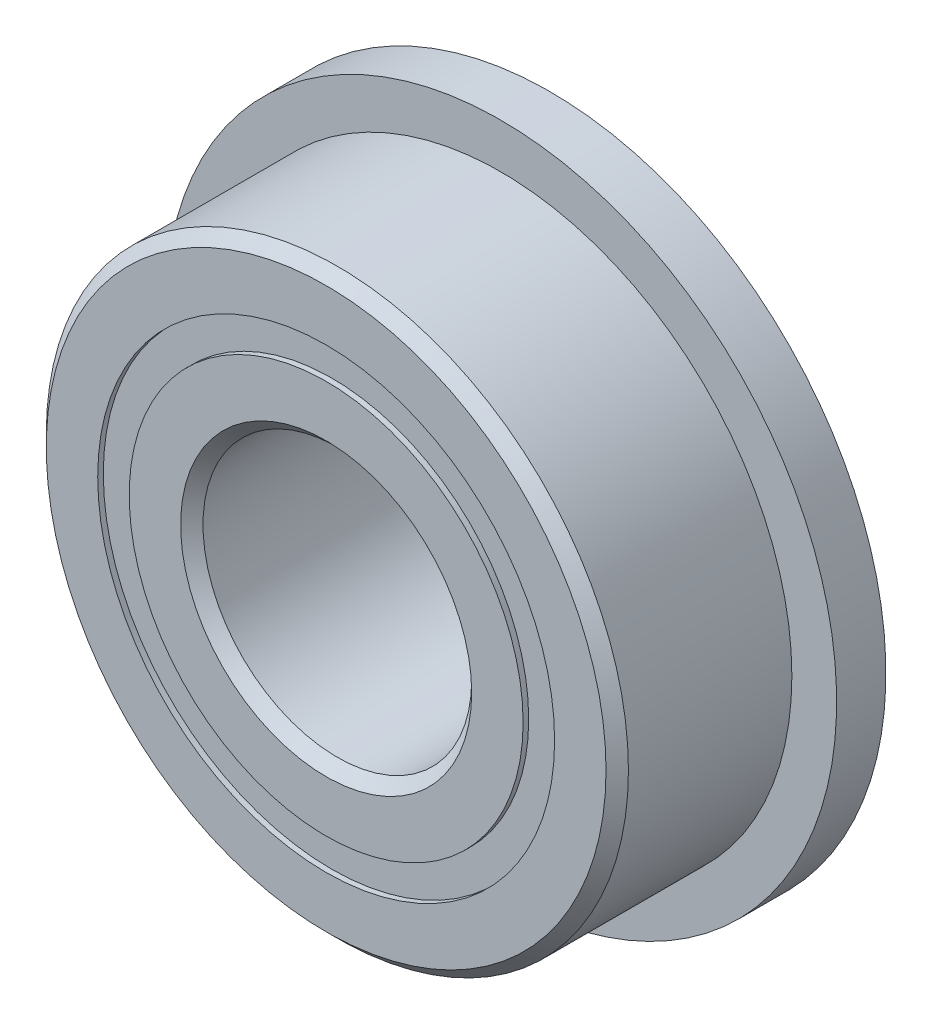
ISO-10303-21;
HEADER;
FILE_DESCRIPTION(('STEP AP214'),'2;1');
FILE_NAME('part.step','',(''),(''),'','','');
FILE_SCHEMA(('AUTOMOTIVE_DESIGN { 1 0 10303 214 1 1 1 1 }'));
ENDSEC;
DATA;
#1=APPLICATION_CONTEXT('core data for automotive mechanical design processes');
#2=APPLICATION_PROTOCOL_DEFINITION('international standard','automotive_design',2000,#1);
#3=PRODUCT_CONTEXT('',#1,'mechanical');
#4=PRODUCT('Part','Part','',(#3));
#5=PRODUCT_RELATED_PRODUCT_CATEGORY('part','',(#4));
#6=PRODUCT_DEFINITION_FORMATION('','',#4);
#7=PRODUCT_DEFINITION_CONTEXT('part definition',#1,'design');
#8=PRODUCT_DEFINITION('design','',#6,#7);
#9=PRODUCT_DEFINITION_SHAPE('','',#8);
#10=(LENGTH_UNIT() NAMED_UNIT(*) SI_UNIT(.MILLI.,.METRE.));
#11=(NAMED_UNIT(*) PLANE_ANGLE_UNIT() SI_UNIT($,.RADIAN.));
#12=(NAMED_UNIT(*) SI_UNIT($,.STERADIAN.) SOLID_ANGLE_UNIT());
#13=UNCERTAINTY_MEASURE_WITH_UNIT(LENGTH_MEASURE(1.E-05),#10,'distance_accuracy_value','');
#14=(GEOMETRIC_REPRESENTATION_CONTEXT(3) GLOBAL_UNCERTAINTY_ASSIGNED_CONTEXT((#13)) GLOBAL_UNIT_ASSIGNED_CONTEXT((#10,
#11,#12)) REPRESENTATION_CONTEXT('',''));
#15=CARTESIAN_POINT('',(0.,0.,0.));
#16=DIRECTION('',(0.,0.,1.));
#17=DIRECTION('',(1.,0.,0.));
#18=AXIS2_PLACEMENT_3D('',#15,#16,#17);
#19=CARTESIAN_POINT('',(0.,5.10164835164835,-2.375));
#20=DIRECTION('',(0.,0.,1.));
#21=DIRECTION('',(1.,0.,0.));
#22=AXIS2_PLACEMENT_3D('',#19,#20,#21);
#23=PLANE('',#22);
#24=CARTESIAN_POINT('',(0.,0.,-2.375));
#25=DIRECTION('',(0.,0.,1.));
#26=DIRECTION('',(1.,0.,0.));
#27=AXIS2_PLACEMENT_3D('',#24,#25,#26);
#28=CIRCLE('',#27,5.10164835164835);
#29=CARTESIAN_POINT('',(5.10164835164835,0.,-2.375));
#30=VERTEX_POINT('',#29);
#31=EDGE_CURVE('E56',#30,#30,#28,.T.);
#32=ORIENTED_EDGE('',*,*,#31,.F.);
#33=EDGE_LOOP('',(#32));
#34=FACE_BOUND('',#33,.T.);
#35=CARTESIAN_POINT('',(0.,0.,-2.375));
#36=DIRECTION('',(0.,0.,1.));
#37=DIRECTION('',(1.,0.,0.));
#38=AXIS2_PLACEMENT_3D('',#35,#36,#37);
#39=CIRCLE('',#38,4.39835164835165);
#40=CARTESIAN_POINT('',(4.39835164835165,0.,-2.375));
#41=VERTEX_POINT('',#40);
#42=EDGE_CURVE('E11',#41,#41,#39,.T.);
#43=ORIENTED_EDGE('',*,*,#42,.T.);
#44=EDGE_LOOP('',(#43));
#45=FACE_BOUND('',#44,.T.);
#46=ADVANCED_FACE('F42',(#34,#45),#23,.F.);
#47=CARTESIAN_POINT('',(0.,0.,2.5));
#48=DIRECTION('',(0.,0.,1.));
#49=DIRECTION('',(1.,0.,0.));
#50=AXIS2_PLACEMENT_3D('',#47,#48,#49);
#51=CYLINDRICAL_SURFACE('',#50,4.39835164835165);
#52=ORIENTED_EDGE('',*,*,#42,.F.);
#53=EDGE_LOOP('',(#52));
#54=FACE_BOUND('',#53,.T.);
#55=CARTESIAN_POINT('',(0.,0.,-1.16542887575844));
#56=DIRECTION('',(0.,0.,1.));
#57=DIRECTION('',(1.,0.,0.));
#58=AXIS2_PLACEMENT_3D('',#55,#56,#57);
#59=CIRCLE('',#58,4.39835164835165);
#60=CARTESIAN_POINT('',(4.39835164835165,0.,-1.16542887575844));
#61=VERTEX_POINT('',#60);
#62=EDGE_CURVE('E48',#61,#61,#59,.T.);
#63=ORIENTED_EDGE('',*,*,#62,.T.);
#64=EDGE_LOOP('',(#63));
#65=FACE_BOUND('',#64,.T.);
#66=ADVANCED_FACE('F65',(#54,#65),#51,.F.);
#67=CARTESIAN_POINT('',(0.,5.10164835164835,-1.16542887575844));
#68=DIRECTION('',(0.,0.,-1.));
#69=DIRECTION('',(-1.,0.,0.));
#70=AXIS2_PLACEMENT_3D('',#67,#68,#69);
#71=PLANE('',#70);
#72=ORIENTED_EDGE('',*,*,#62,.F.);
#73=EDGE_LOOP('',(#72));
#74=FACE_BOUND('',#73,.T.);
#75=CARTESIAN_POINT('',(0.,0.,-1.16542887575844));
#76=DIRECTION('',(0.,0.,1.));
#77=DIRECTION('',(1.,0.,0.));
#78=AXIS2_PLACEMENT_3D('',#75,#76,#77);
#79=CIRCLE('',#78,5.10164835164835);
#80=CARTESIAN_POINT('',(5.10164835164835,0.,-1.16542887575844));
#81=VERTEX_POINT('',#80);
#82=EDGE_CURVE('E52',#81,#81,#79,.T.);
#83=ORIENTED_EDGE('',*,*,#82,.T.);
#84=EDGE_LOOP('',(#83));
#85=FACE_BOUND('',#84,.T.);
#86=ADVANCED_FACE('F69',(#74,#85),#71,.F.);
#87=CARTESIAN_POINT('',(0.,0.,2.5));
#88=DIRECTION('',(0.,0.,1.));
#89=DIRECTION('',(1.,0.,0.));
#90=AXIS2_PLACEMENT_3D('',#87,#88,#89);
#91=CYLINDRICAL_SURFACE('',#90,5.10164835164835);
#92=ORIENTED_EDGE('',*,*,#82,.F.);
#93=EDGE_LOOP('',(#92));
#94=FACE_BOUND('',#93,.T.);
#95=ORIENTED_EDGE('',*,*,#31,.T.);
#96=EDGE_LOOP('',(#95));
#97=FACE_BOUND('',#96,.T.);
#98=ADVANCED_FACE('F62',(#94,#97),#91,.T.);
#99=CLOSED_SHELL('',(#46,#66,#86,#98));
#100=MANIFOLD_SOLID_BREP('B2',#99);
#101=CARTESIAN_POINT('',(0.,5.10164835164835,2.375));
#102=DIRECTION('',(0.,0.,-1.));
#103=DIRECTION('',(-1.,0.,0.));
#104=AXIS2_PLACEMENT_3D('',#101,#102,#103);
#105=PLANE('',#104);
#106=CARTESIAN_POINT('',(0.,0.,2.375));
#107=DIRECTION('',(0.,0.,1.));
#108=DIRECTION('',(1.,0.,0.));
#109=AXIS2_PLACEMENT_3D('',#106,#107,#108);
#110=CIRCLE('',#109,4.39835164835165);
#111=CARTESIAN_POINT('',(4.39835164835165,0.,2.375));
#112=VERTEX_POINT('',#111);
#113=EDGE_CURVE('E41',#112,#112,#110,.T.);
#114=ORIENTED_EDGE('',*,*,#113,.F.);
#115=EDGE_LOOP('',(#114));
#116=FACE_BOUND('',#115,.T.);
#117=CARTESIAN_POINT('',(0.,0.,2.375));
#118=DIRECTION('',(0.,0.,1.));
#119=DIRECTION('',(1.,0.,0.));
#120=AXIS2_PLACEMENT_3D('',#117,#118,#119);
#121=CIRCLE('',#120,5.10164835164835);
#122=CARTESIAN_POINT('',(5.10164835164835,0.,2.375));
#123=VERTEX_POINT('',#122);
#124=EDGE_CURVE('E124',#123,#123,#121,.T.);
#125=ORIENTED_EDGE('',*,*,#124,.T.);
#126=EDGE_LOOP('',(#125));
#127=FACE_BOUND('',#126,.T.);
#128=ADVANCED_FACE('F110',(#116,#127),#105,.F.);
#129=CARTESIAN_POINT('',(0.,0.,2.5));
#130=DIRECTION('',(0.,0.,1.));
#131=DIRECTION('',(1.,0.,0.));
#132=AXIS2_PLACEMENT_3D('',#129,#130,#131);
#133=CYLINDRICAL_SURFACE('',#132,4.39835164835165);
#134=CARTESIAN_POINT('',(0.,0.,1.16542887575843));
#135=DIRECTION('',(0.,0.,1.));
#136=DIRECTION('',(1.,0.,0.));
#137=AXIS2_PLACEMENT_3D('',#134,#135,#136);
#138=CIRCLE('',#137,4.39835164835165);
#139=CARTESIAN_POINT('',(4.39835164835165,0.,1.16542887575843));
#140=VERTEX_POINT('',#139);
#141=EDGE_CURVE('E116',#140,#140,#138,.T.);
#142=ORIENTED_EDGE('',*,*,#141,.F.);
#143=EDGE_LOOP('',(#142));
#144=FACE_BOUND('',#143,.T.);
#145=ORIENTED_EDGE('',*,*,#113,.T.);
#146=EDGE_LOOP('',(#145));
#147=FACE_BOUND('',#146,.T.);
#148=ADVANCED_FACE('F139',(#144,#147),#133,.F.);
#149=CARTESIAN_POINT('',(0.,5.10164835164835,1.16542887575843));
#150=DIRECTION('',(0.,0.,1.));
#151=DIRECTION('',(1.,0.,0.));
#152=AXIS2_PLACEMENT_3D('',#149,#150,#151);
#153=PLANE('',#152);
#154=CARTESIAN_POINT('',(0.,0.,1.16542887575843));
#155=DIRECTION('',(0.,0.,1.));
#156=DIRECTION('',(1.,0.,0.));
#157=AXIS2_PLACEMENT_3D('',#154,#155,#156);
#158=CIRCLE('',#157,5.10164835164835);
#159=CARTESIAN_POINT('',(5.10164835164835,0.,1.16542887575843));
#160=VERTEX_POINT('',#159);
#161=EDGE_CURVE('E120',#160,#160,#158,.T.);
#162=ORIENTED_EDGE('',*,*,#161,.F.);
#163=EDGE_LOOP('',(#162));
#164=FACE_BOUND('',#163,.T.);
#165=ORIENTED_EDGE('',*,*,#141,.T.);
#166=EDGE_LOOP('',(#165));
#167=FACE_BOUND('',#166,.T.);
#168=ADVANCED_FACE('F134',(#164,#167),#153,.F.);
#169=CARTESIAN_POINT('',(0.,0.,2.5));
#170=DIRECTION('',(0.,0.,1.));
#171=DIRECTION('',(1.,0.,0.));
#172=AXIS2_PLACEMENT_3D('',#169,#170,#171);
#173=CYLINDRICAL_SURFACE('',#172,5.10164835164835);
#174=ORIENTED_EDGE('',*,*,#124,.F.);
#175=EDGE_LOOP('',(#174));
#176=FACE_BOUND('',#175,.T.);
#177=ORIENTED_EDGE('',*,*,#161,.T.);
#178=EDGE_LOOP('',(#177));
#179=FACE_BOUND('',#178,.T.);
#180=ADVANCED_FACE('F131',(#176,#179),#173,.T.);
#181=CLOSED_SHELL('',(#128,#148,#168,#180));
#182=MANIFOLD_SOLID_BREP('B6',#181);
#183=CARTESIAN_POINT('',(-2.37499999999995,4.11362066797611,0.));
#184=DIRECTION('',(0.,0.,1.));
#185=DIRECTION('',(0.499999999999989,-0.866025403784445,0.));
#186=AXIS2_PLACEMENT_3D('',#183,#184,#185);
#187=SPHERICAL_SURFACE('',#186,1.16542887575844);
#188=CARTESIAN_POINT('',(-2.37499999999995,4.11362066797611,1.16542887575843));
#189=VERTEX_POINT('',#188);
#190=VERTEX_LOOP('',#189);
#191=FACE_BOUND('',#190,.T.);
#192=ADVANCED_FACE('F177',(#191),#187,.T.);
#193=CLOSED_SHELL('',(#192));
#194=MANIFOLD_SOLID_BREP('B36',#193);
#195=CARTESIAN_POINT('',(-4.11362066797606,2.37500000000005,0.));
#196=DIRECTION('',(0.,0.,1.));
#197=DIRECTION('',(0.866025403784433,-0.50000000000001,0.));
#198=AXIS2_PLACEMENT_3D('',#195,#196,#197);
#199=SPHERICAL_SURFACE('',#198,1.16542887575844);
#200=CARTESIAN_POINT('',(-4.11362066797606,2.37500000000005,1.16542887575843));
#201=VERTEX_POINT('',#200);
#202=VERTEX_LOOP('',#201);
#203=FACE_BOUND('',#202,.T.);
#204=ADVANCED_FACE('F197',(#203),#199,.T.);
#205=CLOSED_SHELL('',(#204));
#206=MANIFOLD_SOLID_BREP('B106',#205);
#207=CARTESIAN_POINT('',(-4.75,0.,0.));
#208=DIRECTION('',(0.,0.,1.));
#209=DIRECTION('',(1.,0.,0.));
#210=AXIS2_PLACEMENT_3D('',#207,#208,#209);
#211=SPHERICAL_SURFACE('',#210,1.16542887575844);
#212=CARTESIAN_POINT('',(-4.75,0.,1.16542887575843));
#213=VERTEX_POINT('',#212);
#214=VERTEX_LOOP('',#213);
#215=FACE_BOUND('',#214,.T.);
#216=ADVANCED_FACE('F217',(#215),#211,.T.);
#217=CLOSED_SHELL('',(#216));
#218=MANIFOLD_SOLID_BREP('B173',#217);
#219=CARTESIAN_POINT('',(-4.1136206679761,-2.37499999999996,0.));
#220=DIRECTION('',(0.,0.,1.));
#221=DIRECTION('',(0.866025403784443,0.499999999999992,0.));
#222=AXIS2_PLACEMENT_3D('',#219,#220,#221);
#223=SPHERICAL_SURFACE('',#222,1.16542887575844);
#224=CARTESIAN_POINT('',(-4.1136206679761,-2.37499999999996,1.16542887575843));
#225=VERTEX_POINT('',#224);
#226=VERTEX_LOOP('',#225);
#227=FACE_BOUND('',#226,.T.);
#228=ADVANCED_FACE('F237',(#227),#223,.T.);
#229=CLOSED_SHELL('',(#228));
#230=MANIFOLD_SOLID_BREP('B193',#229);
#231=CARTESIAN_POINT('',(-2.37500000000003,-4.11362066797606,0.));
#232=DIRECTION('',(0.,0.,1.));
#233=DIRECTION('',(0.500000000000007,0.866025403784435,0.));
#234=AXIS2_PLACEMENT_3D('',#231,#232,#233);
#235=SPHERICAL_SURFACE('',#234,1.16542887575844);
#236=CARTESIAN_POINT('',(-2.37500000000003,-4.11362066797606,1.16542887575843));
#237=VERTEX_POINT('',#236);
#238=VERTEX_LOOP('',#237);
#239=FACE_BOUND('',#238,.T.);
#240=ADVANCED_FACE('F257',(#239),#235,.T.);
#241=CLOSED_SHELL('',(#240));
#242=MANIFOLD_SOLID_BREP('B213',#241);
#243=CARTESIAN_POINT('',(0.,-4.75,0.));
#244=DIRECTION('',(0.,0.,1.));
#245=DIRECTION('',(0.,1.,0.));
#246=AXIS2_PLACEMENT_3D('',#243,#244,#245);
#247=SPHERICAL_SURFACE('',#246,1.16542887575844);
#248=CARTESIAN_POINT('',(0.,-4.75,1.16542887575843));
#249=VERTEX_POINT('',#248);
#250=VERTEX_LOOP('',#249);
#251=FACE_BOUND('',#250,.T.);
#252=ADVANCED_FACE('F277',(#251),#247,.T.);
#253=CLOSED_SHELL('',(#252));
#254=MANIFOLD_SOLID_BREP('B233',#253);
#255=CARTESIAN_POINT('',(2.37499999999998,-4.1136206679761,0.));
#256=DIRECTION('',(0.,0.,1.));
#257=DIRECTION('',(-0.499999999999995,0.866025403784442,0.));
#258=AXIS2_PLACEMENT_3D('',#255,#256,#257);
#259=SPHERICAL_SURFACE('',#258,1.16542887575844);
#260=CARTESIAN_POINT('',(2.37499999999998,-4.1136206679761,1.16542887575843));
#261=VERTEX_POINT('',#260);
#262=VERTEX_LOOP('',#261);
#263=FACE_BOUND('',#262,.T.);
#264=ADVANCED_FACE('F297',(#263),#259,.T.);
#265=CLOSED_SHELL('',(#264));
#266=MANIFOLD_SOLID_BREP('B253',#265);
#267=CARTESIAN_POINT('',(4.11362066797607,-2.37500000000002,0.));
#268=DIRECTION('',(0.,0.,1.));
#269=DIRECTION('',(-0.866025403784436,0.500000000000004,0.));
#270=AXIS2_PLACEMENT_3D('',#267,#268,#269);
#271=SPHERICAL_SURFACE('',#270,1.16542887575844);
#272=CARTESIAN_POINT('',(4.11362066797607,-2.37500000000002,1.16542887575843));
#273=VERTEX_POINT('',#272);
#274=VERTEX_LOOP('',#273);
#275=FACE_BOUND('',#274,.T.);
#276=ADVANCED_FACE('F317',(#275),#271,.T.);
#277=CLOSED_SHELL('',(#276));
#278=MANIFOLD_SOLID_BREP('B273',#277);
#279=CARTESIAN_POINT('',(4.75,0.,0.));
#280=DIRECTION('',(0.,0.,1.));
#281=DIRECTION('',(-1.,0.,0.));
#282=AXIS2_PLACEMENT_3D('',#279,#280,#281);
#283=SPHERICAL_SURFACE('',#282,1.16542887575844);
#284=CARTESIAN_POINT('',(4.75,0.,1.16542887575843));
#285=VERTEX_POINT('',#284);
#286=VERTEX_LOOP('',#285);
#287=FACE_BOUND('',#286,.T.);
#288=ADVANCED_FACE('F337',(#287),#283,.T.);
#289=CLOSED_SHELL('',(#288));
#290=MANIFOLD_SOLID_BREP('B293',#289);
#291=CARTESIAN_POINT('',(4.11362066797609,2.37499999999999,0.));
#292=DIRECTION('',(0.,0.,1.));
#293=DIRECTION('',(-0.86602540378444,-0.499999999999998,0.));
#294=AXIS2_PLACEMENT_3D('',#291,#292,#293);
#295=SPHERICAL_SURFACE('',#294,1.16542887575844);
#296=CARTESIAN_POINT('',(4.11362066797609,2.37499999999999,1.16542887575843));
#297=VERTEX_POINT('',#296);
#298=VERTEX_LOOP('',#297);
#299=FACE_BOUND('',#298,.T.);
#300=ADVANCED_FACE('F357',(#299),#295,.T.);
#301=CLOSED_SHELL('',(#300));
#302=MANIFOLD_SOLID_BREP('B313',#301);
#303=CARTESIAN_POINT('',(2.375,4.11362066797608,0.));
#304=DIRECTION('',(0.,0.,1.));
#305=DIRECTION('',(-0.500000000000001,-0.866025403784438,0.));
#306=AXIS2_PLACEMENT_3D('',#303,#304,#305);
#307=SPHERICAL_SURFACE('',#306,1.16542887575844);
#308=CARTESIAN_POINT('',(2.375,4.11362066797608,1.16542887575843));
#309=VERTEX_POINT('',#308);
#310=VERTEX_LOOP('',#309);
#311=FACE_BOUND('',#310,.T.);
#312=ADVANCED_FACE('F377',(#311),#307,.T.);
#313=CLOSED_SHELL('',(#312));
#314=MANIFOLD_SOLID_BREP('B333',#313);
#315=CARTESIAN_POINT('',(0.,4.75,0.));
#316=DIRECTION('',(0.,0.,1.));
#317=DIRECTION('',(0.,-1.,0.));
#318=AXIS2_PLACEMENT_3D('',#315,#316,#317);
#319=SPHERICAL_SURFACE('',#318,1.16542887575844);
#320=CARTESIAN_POINT('',(0.,4.75,1.16542887575843));
#321=VERTEX_POINT('',#320);
#322=VERTEX_LOOP('',#321);
#323=FACE_BOUND('',#322,.T.);
#324=ADVANCED_FACE('F400',(#323),#319,.T.);
#325=CLOSED_SHELL('',(#324));
#326=MANIFOLD_SOLID_BREP('B353',#325);
#327=CARTESIAN_POINT('',(0.,4.39835164835165,2.5));
#328=DIRECTION('',(0.,0.,-1.));
#329=DIRECTION('',(-1.,0.,0.));
#330=AXIS2_PLACEMENT_3D('',#327,#328,#329);
#331=PLANE('',#330);
#332=CARTESIAN_POINT('',(0.,0.,2.5));
#333=DIRECTION('',(0.,0.,1.));
#334=DIRECTION('',(1.,0.,0.));
#335=AXIS2_PLACEMENT_3D('',#332,#333,#334);
#336=CIRCLE('',#335,3.25);
#337=CARTESIAN_POINT('',(3.25,0.,2.5));
#338=VERTEX_POINT('',#337);
#339=EDGE_CURVE('E448',#338,#338,#336,.T.);
#340=ORIENTED_EDGE('',*,*,#339,.F.);
#341=EDGE_LOOP('',(#340));
#342=FACE_BOUND('',#341,.T.);
#343=CARTESIAN_POINT('',(0.,0.,2.5));
#344=DIRECTION('',(0.,0.,1.));
#345=DIRECTION('',(1.,0.,0.));
#346=AXIS2_PLACEMENT_3D('',#343,#344,#345);
#347=CIRCLE('',#346,4.39835164835165);
#348=CARTESIAN_POINT('',(4.39835164835165,0.,2.5));
#349=VERTEX_POINT('',#348);
#350=EDGE_CURVE('E399',#349,#349,#347,.T.);
#351=ORIENTED_EDGE('',*,*,#350,.T.);
#352=EDGE_LOOP('',(#351));
#353=FACE_BOUND('',#352,.T.);
#354=ADVANCED_FACE('F420',(#342,#353),#331,.F.);
#355=CARTESIAN_POINT('',(0.,0.,2.5));
#356=DIRECTION('',(0.,0.,1.));
#357=DIRECTION('',(1.,0.,0.));
#358=AXIS2_PLACEMENT_3D('',#355,#356,#357);
#359=CYLINDRICAL_SURFACE('',#358,4.39835164835165);
#360=ORIENTED_EDGE('',*,*,#350,.F.);
#361=EDGE_LOOP('',(#360));
#362=FACE_BOUND('',#361,.T.);
#363=CARTESIAN_POINT('',(0.,0.,1.11111111111111));
#364=DIRECTION('',(0.,0.,1.));
#365=DIRECTION('',(1.,0.,0.));
#366=AXIS2_PLACEMENT_3D('',#363,#364,#365);
#367=CIRCLE('',#366,4.39835164835165);
#368=CARTESIAN_POINT('',(4.39835164835165,0.,1.11111111111111));
#369=VERTEX_POINT('',#368);
#370=EDGE_CURVE('E426',#369,#369,#367,.T.);
#371=ORIENTED_EDGE('',*,*,#370,.T.);
#372=EDGE_LOOP('',(#371));
#373=FACE_BOUND('',#372,.T.);
#374=ADVANCED_FACE('F455',(#362,#373),#359,.T.);
#375=CARTESIAN_POINT('',(0.,0.,0.));
#376=DIRECTION('',(0.,0.,1.));
#377=DIRECTION('',(1.,0.,0.));
#378=AXIS2_PLACEMENT_3D('',#375,#376,#377);
#379=TOROIDAL_SURFACE('',#378,4.75,1.16542887575843);
#380=ORIENTED_EDGE('',*,*,#370,.F.);
#381=EDGE_LOOP('',(#380));
#382=FACE_BOUND('',#381,.T.);
#383=CARTESIAN_POINT('',(0.,0.,-1.11111111111111));
#384=DIRECTION('',(0.,0.,1.));
#385=DIRECTION('',(1.,0.,0.));
#386=AXIS2_PLACEMENT_3D('',#383,#384,#385);
#387=CIRCLE('',#386,4.39835164835165);
#388=CARTESIAN_POINT('',(4.39835164835165,0.,-1.11111111111111));
#389=VERTEX_POINT('',#388);
#390=EDGE_CURVE('E430',#389,#389,#387,.T.);
#391=ORIENTED_EDGE('',*,*,#390,.T.);
#392=EDGE_LOOP('',(#391));
#393=FACE_BOUND('',#392,.T.);
#394=ADVANCED_FACE('F459',(#382,#393),#379,.F.);
#395=CARTESIAN_POINT('',(0.,0.,2.5));
#396=DIRECTION('',(0.,0.,1.));
#397=DIRECTION('',(1.,0.,0.));
#398=AXIS2_PLACEMENT_3D('',#395,#396,#397);
#399=CYLINDRICAL_SURFACE('',#398,4.39835164835165);
#400=ORIENTED_EDGE('',*,*,#390,.F.);
#401=EDGE_LOOP('',(#400));
#402=FACE_BOUND('',#401,.T.);
#403=CARTESIAN_POINT('',(0.,0.,-2.5));
#404=DIRECTION('',(0.,0.,1.));
#405=DIRECTION('',(1.,0.,0.));
#406=AXIS2_PLACEMENT_3D('',#403,#404,#405);
#407=CIRCLE('',#406,4.39835164835165);
#408=CARTESIAN_POINT('',(4.39835164835165,0.,-2.5));
#409=VERTEX_POINT('',#408);
#410=EDGE_CURVE('E434',#409,#409,#407,.T.);
#411=ORIENTED_EDGE('',*,*,#410,.T.);
#412=EDGE_LOOP('',(#411));
#413=FACE_BOUND('',#412,.T.);
#414=ADVANCED_FACE('F464',(#402,#413),#399,.T.);
#415=CARTESIAN_POINT('',(0.,3.25,-2.5));
#416=DIRECTION('',(0.,0.,1.));
#417=DIRECTION('',(1.,0.,0.));
#418=AXIS2_PLACEMENT_3D('',#415,#416,#417);
#419=PLANE('',#418);
#420=ORIENTED_EDGE('',*,*,#410,.F.);
#421=EDGE_LOOP('',(#420));
#422=FACE_BOUND('',#421,.T.);
#423=CARTESIAN_POINT('',(0.,0.,-2.5));
#424=DIRECTION('',(0.,0.,1.));
#425=DIRECTION('',(1.,0.,0.));
#426=AXIS2_PLACEMENT_3D('',#423,#424,#425);
#427=CIRCLE('',#426,3.25);
#428=CARTESIAN_POINT('',(3.25,0.,-2.5));
#429=VERTEX_POINT('',#428);
#430=EDGE_CURVE('E439',#429,#429,#427,.T.);
#431=ORIENTED_EDGE('',*,*,#430,.T.);
#432=EDGE_LOOP('',(#431));
#433=FACE_BOUND('',#432,.T.);
#434=ADVANCED_FACE('F470',(#422,#433),#419,.F.);
#435=CARTESIAN_POINT('',(0.,0.,-2.25));
#436=DIRECTION('',(0.,0.,-1.));
#437=DIRECTION('',(-1.,0.,0.));
#438=AXIS2_PLACEMENT_3D('',#435,#436,#437);
#439=CONICAL_SURFACE('',#438,3.,0.785398163397448);
#440=ORIENTED_EDGE('',*,*,#430,.F.);
#441=EDGE_LOOP('',(#440));
#442=FACE_BOUND('',#441,.T.);
#443=CARTESIAN_POINT('',(0.,0.,-2.25));
#444=DIRECTION('',(0.,0.,1.));
#445=DIRECTION('',(1.,0.,0.));
#446=AXIS2_PLACEMENT_3D('',#443,#444,#445);
#447=CIRCLE('',#446,3.);
#448=CARTESIAN_POINT('',(3.,0.,-2.25));
#449=VERTEX_POINT('',#448);
#450=EDGE_CURVE('E442',#449,#449,#447,.T.);
#451=ORIENTED_EDGE('',*,*,#450,.T.);
#452=EDGE_LOOP('',(#451));
#453=FACE_BOUND('',#452,.T.);
#454=ADVANCED_FACE('F474',(#442,#453),#439,.F.);
#455=CARTESIAN_POINT('',(0.,0.,2.5));
#456=DIRECTION('',(0.,0.,1.));
#457=DIRECTION('',(1.,0.,0.));
#458=AXIS2_PLACEMENT_3D('',#455,#456,#457);
#459=CYLINDRICAL_SURFACE('',#458,3.);
#460=ORIENTED_EDGE('',*,*,#450,.F.);
#461=EDGE_LOOP('',(#460));
#462=FACE_BOUND('',#461,.T.);
#463=CARTESIAN_POINT('',(0.,0.,2.25));
#464=DIRECTION('',(0.,0.,1.));
#465=DIRECTION('',(1.,0.,0.));
#466=AXIS2_PLACEMENT_3D('',#463,#464,#465);
#467=CIRCLE('',#466,3.);
#468=CARTESIAN_POINT('',(3.,0.,2.25));
#469=VERTEX_POINT('',#468);
#470=EDGE_CURVE('E445',#469,#469,#467,.T.);
#471=ORIENTED_EDGE('',*,*,#470,.T.);
#472=EDGE_LOOP('',(#471));
#473=FACE_BOUND('',#472,.T.);
#474=ADVANCED_FACE('F478',(#462,#473),#459,.F.);
#475=CARTESIAN_POINT('',(0.,0.,2.5));
#476=DIRECTION('',(0.,0.,1.));
#477=DIRECTION('',(1.,0.,0.));
#478=AXIS2_PLACEMENT_3D('',#475,#476,#477);
#479=CONICAL_SURFACE('',#478,3.25,0.785398163397449);
#480=ORIENTED_EDGE('',*,*,#470,.F.);
#481=EDGE_LOOP('',(#480));
#482=FACE_BOUND('',#481,.T.);
#483=ORIENTED_EDGE('',*,*,#339,.T.);
#484=EDGE_LOOP('',(#483));
#485=FACE_BOUND('',#484,.T.);
#486=ADVANCED_FACE('F452',(#482,#485),#479,.F.);
#487=CLOSED_SHELL('',(#354,#374,#394,#414,#434,#454,#474,#486));
#488=MANIFOLD_SOLID_BREP('B373',#487);
#489=CARTESIAN_POINT('',(0.,0.,2.25));
#490=DIRECTION('',(0.,0.,-1.));
#491=DIRECTION('',(-1.,0.,0.));
#492=AXIS2_PLACEMENT_3D('',#489,#490,#491);
#493=CONICAL_SURFACE('',#492,6.5,0.785398163397449);
#494=CARTESIAN_POINT('',(0.,0.,2.5));
#495=DIRECTION('',(0.,0.,1.));
#496=DIRECTION('',(1.,0.,0.));
#497=AXIS2_PLACEMENT_3D('',#494,#495,#496);
#498=CIRCLE('',#497,6.25);
#499=CARTESIAN_POINT('',(6.25,0.,2.5));
#500=VERTEX_POINT('',#499);
#501=EDGE_CURVE('E564',#500,#500,#498,.T.);
#502=ORIENTED_EDGE('',*,*,#501,.F.);
#503=EDGE_LOOP('',(#502));
#504=FACE_BOUND('',#503,.T.);
#505=CARTESIAN_POINT('',(0.,0.,2.25));
#506=DIRECTION('',(0.,0.,1.));
#507=DIRECTION('',(1.,0.,0.));
#508=AXIS2_PLACEMENT_3D('',#505,#506,#507);
#509=CIRCLE('',#508,6.5);
#510=CARTESIAN_POINT('',(6.5,0.,2.25));
#511=VERTEX_POINT('',#510);
#512=EDGE_CURVE('E419',#511,#511,#509,.T.);
#513=ORIENTED_EDGE('',*,*,#512,.T.);
#514=EDGE_LOOP('',(#513));
#515=FACE_BOUND('',#514,.T.);
#516=ADVANCED_FACE('F542',(#504,#515),#493,.T.);
#517=CARTESIAN_POINT('',(0.,0.,2.5));
#518=DIRECTION('',(0.,0.,1.));
#519=DIRECTION('',(1.,0.,0.));
#520=AXIS2_PLACEMENT_3D('',#517,#518,#519);
#521=CYLINDRICAL_SURFACE('',#520,6.5);
#522=CARTESIAN_POINT('',(0.,0.,-1.4));
#523=DIRECTION('',(0.,0.,1.));
#524=DIRECTION('',(1.,0.,0.));
#525=AXIS2_PLACEMENT_3D('',#522,#523,#524);
#526=CIRCLE('',#525,6.5);
#527=CARTESIAN_POINT('',(6.5,0.,-1.4));
#528=VERTEX_POINT('',#527);
#529=EDGE_CURVE('E567',#528,#528,#526,.T.);
#530=ORIENTED_EDGE('',*,*,#529,.T.);
#531=EDGE_LOOP('',(#530));
#532=FACE_BOUND('',#531,.T.);
#533=ORIENTED_EDGE('',*,*,#512,.F.);
#534=EDGE_LOOP('',(#533));
#535=FACE_BOUND('',#534,.T.);
#536=ADVANCED_FACE('F587',(#532,#535),#521,.T.);
#537=CARTESIAN_POINT('',(0.,6.25,-2.5));
#538=DIRECTION('',(0.,0.,1.));
#539=DIRECTION('',(1.,0.,0.));
#540=AXIS2_PLACEMENT_3D('',#537,#538,#539);
#541=PLANE('',#540);
#542=CARTESIAN_POINT('',(0.,0.,-2.5));
#543=DIRECTION('',(0.,0.,1.));
#544=DIRECTION('',(1.,0.,0.));
#545=AXIS2_PLACEMENT_3D('',#542,#543,#544);
#546=CIRCLE('',#545,5.10164835164835);
#547=CARTESIAN_POINT('',(5.10164835164835,0.,-2.5));
#548=VERTEX_POINT('',#547);
#549=EDGE_CURVE('E548',#548,#548,#546,.T.);
#550=ORIENTED_EDGE('',*,*,#549,.T.);
#551=EDGE_LOOP('',(#550));
#552=FACE_BOUND('',#551,.T.);
#553=CARTESIAN_POINT('',(0.,0.,-2.5));
#554=DIRECTION('',(0.,0.,-1.));
#555=DIRECTION('',(-1.,0.,0.));
#556=AXIS2_PLACEMENT_3D('',#553,#554,#555);
#557=CIRCLE('',#556,7.5);
#558=CARTESIAN_POINT('',(-7.5,0.,-2.5));
#559=VERTEX_POINT('',#558);
#560=EDGE_CURVE('E570',#559,#559,#557,.T.);
#561=ORIENTED_EDGE('',*,*,#560,.T.);
#562=EDGE_LOOP('',(#561));
#563=FACE_BOUND('',#562,.T.);
#564=ADVANCED_FACE('F590',(#552,#563),#541,.F.);
#565=CARTESIAN_POINT('',(0.,0.,2.5));
#566=DIRECTION('',(0.,0.,1.));
#567=DIRECTION('',(1.,0.,0.));
#568=AXIS2_PLACEMENT_3D('',#565,#566,#567);
#569=CYLINDRICAL_SURFACE('',#568,5.10164835164835);
#570=CARTESIAN_POINT('',(0.,0.,-1.11111111111111));
#571=DIRECTION('',(0.,0.,1.));
#572=DIRECTION('',(1.,0.,0.));
#573=AXIS2_PLACEMENT_3D('',#570,#571,#572);
#574=CIRCLE('',#573,5.10164835164835);
#575=CARTESIAN_POINT('',(5.10164835164835,0.,-1.11111111111111));
#576=VERTEX_POINT('',#575);
#577=EDGE_CURVE('E552',#576,#576,#574,.T.);
#578=ORIENTED_EDGE('',*,*,#577,.T.);
#579=EDGE_LOOP('',(#578));
#580=FACE_BOUND('',#579,.T.);
#581=ORIENTED_EDGE('',*,*,#549,.F.);
#582=EDGE_LOOP('',(#581));
#583=FACE_BOUND('',#582,.T.);
#584=ADVANCED_FACE('F595',(#580,#583),#569,.F.);
#585=CARTESIAN_POINT('',(0.,0.,0.));
#586=DIRECTION('',(0.,0.,1.));
#587=DIRECTION('',(1.,0.,0.));
#588=AXIS2_PLACEMENT_3D('',#585,#586,#587);
#589=TOROIDAL_SURFACE('',#588,4.75,1.16542887575844);
#590=ORIENTED_EDGE('',*,*,#577,.F.);
#591=EDGE_LOOP('',(#590));
#592=FACE_BOUND('',#591,.T.);
#593=CARTESIAN_POINT('',(0.,0.,1.11111111111111));
#594=DIRECTION('',(0.,0.,1.));
#595=DIRECTION('',(1.,0.,0.));
#596=AXIS2_PLACEMENT_3D('',#593,#594,#595);
#597=CIRCLE('',#596,5.10164835164835);
#598=CARTESIAN_POINT('',(5.10164835164835,0.,1.11111111111111));
#599=VERTEX_POINT('',#598);
#600=EDGE_CURVE('E556',#599,#599,#597,.T.);
#601=ORIENTED_EDGE('',*,*,#600,.T.);
#602=EDGE_LOOP('',(#601));
#603=FACE_BOUND('',#602,.T.);
#604=ADVANCED_FACE('F601',(#592,#603),#589,.F.);
#605=CARTESIAN_POINT('',(0.,0.,2.5));
#606=DIRECTION('',(0.,0.,1.));
#607=DIRECTION('',(1.,0.,0.));
#608=AXIS2_PLACEMENT_3D('',#605,#606,#607);
#609=CYLINDRICAL_SURFACE('',#608,5.10164835164835);
#610=ORIENTED_EDGE('',*,*,#600,.F.);
#611=EDGE_LOOP('',(#610));
#612=FACE_BOUND('',#611,.T.);
#613=CARTESIAN_POINT('',(0.,0.,2.5));
#614=DIRECTION('',(0.,0.,1.));
#615=DIRECTION('',(1.,0.,0.));
#616=AXIS2_PLACEMENT_3D('',#613,#614,#615);
#617=CIRCLE('',#616,5.10164835164835);
#618=CARTESIAN_POINT('',(5.10164835164835,0.,2.5));
#619=VERTEX_POINT('',#618);
#620=EDGE_CURVE('E561',#619,#619,#617,.T.);
#621=ORIENTED_EDGE('',*,*,#620,.T.);
#622=EDGE_LOOP('',(#621));
#623=FACE_BOUND('',#622,.T.);
#624=ADVANCED_FACE('F605',(#612,#623),#609,.F.);
#625=CARTESIAN_POINT('',(0.,6.25,2.5));
#626=DIRECTION('',(0.,0.,-1.));
#627=DIRECTION('',(-1.,0.,0.));
#628=AXIS2_PLACEMENT_3D('',#625,#626,#627);
#629=PLANE('',#628);
#630=ORIENTED_EDGE('',*,*,#620,.F.);
#631=EDGE_LOOP('',(#630));
#632=FACE_BOUND('',#631,.T.);
#633=ORIENTED_EDGE('',*,*,#501,.T.);
#634=EDGE_LOOP('',(#633));
#635=FACE_BOUND('',#634,.T.);
#636=ADVANCED_FACE('F583',(#632,#635),#629,.F.);
#637=CARTESIAN_POINT('',(0.,5.10164835164835,-1.4));
#638=DIRECTION('',(0.,0.,1.));
#639=DIRECTION('',(1.,0.,0.));
#640=AXIS2_PLACEMENT_3D('',#637,#638,#639);
#641=PLANE('',#640);
#642=CARTESIAN_POINT('',(0.,0.,-1.4));
#643=DIRECTION('',(0.,0.,-1.));
#644=DIRECTION('',(-1.,0.,0.));
#645=AXIS2_PLACEMENT_3D('',#642,#643,#644);
#646=CIRCLE('',#645,7.5);
#647=CARTESIAN_POINT('',(-7.5,0.,-1.4));
#648=VERTEX_POINT('',#647);
#649=EDGE_CURVE('E573',#648,#648,#646,.T.);
#650=ORIENTED_EDGE('',*,*,#649,.F.);
#651=EDGE_LOOP('',(#650));
#652=FACE_BOUND('',#651,.T.);
#653=ORIENTED_EDGE('',*,*,#529,.F.);
#654=EDGE_LOOP('',(#653));
#655=FACE_BOUND('',#654,.T.);
#656=ADVANCED_FACE('F580',(#652,#655),#641,.T.);
#657=CARTESIAN_POINT('',(0.,0.,-2.5));
#658=DIRECTION('',(0.,0.,-1.));
#659=DIRECTION('',(-1.,0.,0.));
#660=AXIS2_PLACEMENT_3D('',#657,#658,#659);
#661=CYLINDRICAL_SURFACE('',#660,7.5);
#662=ORIENTED_EDGE('',*,*,#649,.T.);
#663=EDGE_LOOP('',(#662));
#664=FACE_BOUND('',#663,.T.);
#665=ORIENTED_EDGE('',*,*,#560,.F.);
#666=EDGE_LOOP('',(#665));
#667=FACE_BOUND('',#666,.T.);
#668=ADVANCED_FACE('F577',(#664,#667),#661,.T.);
#669=CLOSED_SHELL('',(#516,#536,#564,#584,#604,#624,#636,#656,#668));
#670=MANIFOLD_SOLID_BREP('B394',#669);
#671=ADVANCED_BREP_SHAPE_REPRESENTATION('',(#18,#100,#182,#194,#206,#218,#230,#242,#254,#266,
#278,#290,#302,#314,#326,#488,#670),#14);
#672=SHAPE_DEFINITION_REPRESENTATION(#9,#671);
ENDSEC;
END-ISO-10303-21;
